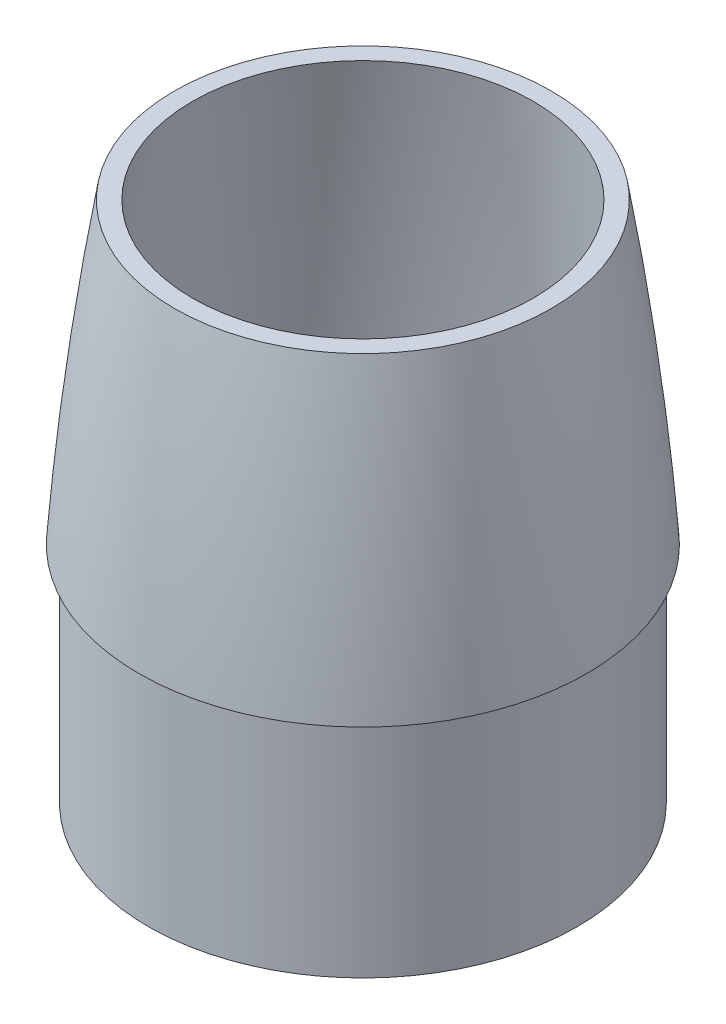
ISO-10303-21;
HEADER;
FILE_DESCRIPTION(('STEP AP214'),'2;1');
FILE_NAME('part.step','',(''),(''),'','','');
FILE_SCHEMA(('AUTOMOTIVE_DESIGN { 1 0 10303 214 1 1 1 1 }'));
ENDSEC;
DATA;
#1=APPLICATION_CONTEXT('core data for automotive mechanical design processes');
#2=APPLICATION_PROTOCOL_DEFINITION('international standard','automotive_design',2000,#1);
#3=PRODUCT_CONTEXT('',#1,'mechanical');
#4=PRODUCT('Part','Part','',(#3));
#5=PRODUCT_RELATED_PRODUCT_CATEGORY('part','',(#4));
#6=PRODUCT_DEFINITION_FORMATION('','',#4);
#7=PRODUCT_DEFINITION_CONTEXT('part definition',#1,'design');
#8=PRODUCT_DEFINITION('design','',#6,#7);
#9=PRODUCT_DEFINITION_SHAPE('','',#8);
#10=(LENGTH_UNIT() NAMED_UNIT(*) SI_UNIT(.MILLI.,.METRE.));
#11=(NAMED_UNIT(*) PLANE_ANGLE_UNIT() SI_UNIT($,.RADIAN.));
#12=(NAMED_UNIT(*) SI_UNIT($,.STERADIAN.) SOLID_ANGLE_UNIT());
#13=UNCERTAINTY_MEASURE_WITH_UNIT(LENGTH_MEASURE(1.E-05),#10,'distance_accuracy_value','');
#14=(GEOMETRIC_REPRESENTATION_CONTEXT(3) GLOBAL_UNCERTAINTY_ASSIGNED_CONTEXT((#13)) GLOBAL_UNIT_ASSIGNED_CONTEXT((#10,
#11,#12)) REPRESENTATION_CONTEXT('',''));
#15=CARTESIAN_POINT('',(0.,0.,0.));
#16=DIRECTION('',(0.,0.,1.));
#17=DIRECTION('',(1.,0.,0.));
#18=AXIS2_PLACEMENT_3D('',#15,#16,#17);
#19=CARTESIAN_POINT('',(2.22044604925031E-13,-77.7824394206784,0.));
#20=DIRECTION('',(0.,1.,0.));
#21=DIRECTION('',(-1.,0.,0.));
#22=AXIS2_PLACEMENT_3D('',#19,#20,#21);
#23=DEGENERATE_TOROIDAL_SURFACE('',#22,1014.39057082294,1093.36082838655,.F.);
#24=CARTESIAN_POINT('',(2.42627023847075E-13,0.,0.));
#25=DIRECTION('',(0.,1.,0.));
#26=DIRECTION('',(-1.,0.,0.));
#27=AXIS2_PLACEMENT_3D('',#24,#25,#26);
#28=CIRCLE('',#27,76.2000000000002);
#29=CARTESIAN_POINT('',(-76.2,0.,0.));
#30=VERTEX_POINT('',#29);
#31=EDGE_CURVE('E47',#30,#30,#28,.T.);
#32=ORIENTED_EDGE('',*,*,#31,.T.);
#33=EDGE_LOOP('',(#32));
#34=FACE_BOUND('',#33,.T.);
#35=CARTESIAN_POINT('',(2.22044604925031E-13,101.6,0.));
#36=DIRECTION('',(0.,1.,0.));
#37=DIRECTION('',(0.,0.,1.));
#38=AXIS2_PLACEMENT_3D('',#35,#36,#37);
#39=CIRCLE('',#38,64.1546723067235);
#40=CARTESIAN_POINT('',(2.22044604925031E-13,101.6,64.1546723067235));
#41=VERTEX_POINT('',#40);
#42=EDGE_CURVE('E58',#41,#41,#39,.F.);
#43=ORIENTED_EDGE('',*,*,#42,.T.);
#44=EDGE_LOOP('',(#43));
#45=FACE_BOUND('',#44,.T.);
#46=ADVANCED_FACE('F39',(#34,#45),#23,.F.);
#47=CARTESIAN_POINT('',(2.22044604925031E-13,-88.4854003678518,0.));
#48=DIRECTION('',(0.,1.,0.));
#49=DIRECTION('',(-1.,0.,0.));
#50=AXIS2_PLACEMENT_3D('',#47,#48,#49);
#51=DEGENERATE_TOROIDAL_SURFACE('',#50,1133.57722716672,1206.67591223346,.F.);
#52=CARTESIAN_POINT('',(2.42627023847075E-13,-1.11022302462516E-13,0.));
#53=DIRECTION('',(0.,1.,0.));
#54=DIRECTION('',(-1.,0.,0.));
#55=AXIS2_PLACEMENT_3D('',#52,#53,#54);
#56=CIRCLE('',#55,69.8500000000002);
#57=CARTESIAN_POINT('',(-69.85,-1.62347249814782E-13,0.));
#58=VERTEX_POINT('',#57);
#59=EDGE_CURVE('E53',#58,#58,#56,.T.);
#60=ORIENTED_EDGE('',*,*,#59,.F.);
#61=EDGE_LOOP('',(#60));
#62=FACE_BOUND('',#61,.T.);
#63=CARTESIAN_POINT('',(2.22044604925031E-13,101.6,0.));
#64=DIRECTION('',(0.,1.,0.));
#65=DIRECTION('',(0.,0.,1.));
#66=AXIS2_PLACEMENT_3D('',#63,#64,#65);
#67=CIRCLE('',#66,58.0327332361936);
#68=CARTESIAN_POINT('',(2.22044604925031E-13,101.6,58.0327332361936));
#69=VERTEX_POINT('',#68);
#70=EDGE_CURVE('E42',#69,#69,#67,.T.);
#71=ORIENTED_EDGE('',*,*,#70,.T.);
#72=EDGE_LOOP('',(#71));
#73=FACE_BOUND('',#72,.T.);
#74=ADVANCED_FACE('F68',(#62,#73),#51,.T.);
#75=CARTESIAN_POINT('',(-76.2,0.,0.));
#76=DIRECTION('',(0.,-1.,0.));
#77=DIRECTION('',(1.,0.,0.));
#78=AXIS2_PLACEMENT_3D('',#75,#76,#77);
#79=PLANE('',#78);
#80=CARTESIAN_POINT('',(0.,0.,0.));
#81=DIRECTION('',(0.,-1.,0.));
#82=DIRECTION('',(1.,0.,0.));
#83=AXIS2_PLACEMENT_3D('',#80,#81,#82);
#84=CIRCLE('',#83,73.025);
#85=CARTESIAN_POINT('',(73.025,-1.2520176551083E-13,0.));
#86=VERTEX_POINT('',#85);
#87=EDGE_CURVE('E10',#86,#86,#84,.T.);
#88=ORIENTED_EDGE('',*,*,#87,.F.);
#89=EDGE_LOOP('',(#88));
#90=FACE_BOUND('',#89,.T.);
#91=ORIENTED_EDGE('',*,*,#31,.F.);
#92=EDGE_LOOP('',(#91));
#93=FACE_BOUND('',#92,.T.);
#94=ADVANCED_FACE('F71',(#90,#93),#79,.T.);
#95=CARTESIAN_POINT('',(0.,101.6,0.));
#96=DIRECTION('',(0.,1.,0.));
#97=DIRECTION('',(0.,0.,1.));
#98=AXIS2_PLACEMENT_3D('',#95,#96,#97);
#99=PLANE('',#98);
#100=ORIENTED_EDGE('',*,*,#42,.F.);
#101=EDGE_LOOP('',(#100));
#102=FACE_BOUND('',#101,.T.);
#103=ORIENTED_EDGE('',*,*,#70,.F.);
#104=EDGE_LOOP('',(#103));
#105=FACE_BOUND('',#104,.T.);
#106=ADVANCED_FACE('F90',(#102,#105),#99,.T.);
#107=CARTESIAN_POINT('',(-1.3064532053304E-13,-76.2,0.));
#108=DIRECTION('',(0.,-1.,0.));
#109=DIRECTION('',(1.,0.,0.));
#110=AXIS2_PLACEMENT_3D('',#107,#108,#109);
#111=PLANE('',#110);
#112=CARTESIAN_POINT('',(-1.3064532053304E-13,-76.2,0.));
#113=DIRECTION('',(0.,-1.,0.));
#114=DIRECTION('',(1.,0.,0.));
#115=AXIS2_PLACEMENT_3D('',#112,#113,#114);
#116=CIRCLE('',#115,73.025);
#117=CARTESIAN_POINT('',(73.0249999999999,-76.2000000000001,0.));
#118=VERTEX_POINT('',#117);
#119=EDGE_CURVE('E56',#118,#118,#116,.T.);
#120=ORIENTED_EDGE('',*,*,#119,.T.);
#121=EDGE_LOOP('',(#120));
#122=FACE_BOUND('',#121,.T.);
#123=CARTESIAN_POINT('',(-1.3064532053304E-13,-76.2,0.));
#124=DIRECTION('',(0.,-1.,0.));
#125=DIRECTION('',(1.,0.,0.));
#126=AXIS2_PLACEMENT_3D('',#123,#124,#125);
#127=CIRCLE('',#126,69.85);
#128=CARTESIAN_POINT('',(69.8499999999999,-76.2000000000001,0.));
#129=VERTEX_POINT('',#128);
#130=EDGE_CURVE('E79',#129,#129,#127,.T.);
#131=ORIENTED_EDGE('',*,*,#130,.F.);
#132=EDGE_LOOP('',(#131));
#133=FACE_BOUND('',#132,.T.);
#134=ADVANCED_FACE('F87',(#122,#133),#111,.T.);
#135=CARTESIAN_POINT('',(-1.3064532053304E-13,-76.2,0.));
#136=DIRECTION('',(0.,1.,0.));
#137=DIRECTION('',(-1.,0.,0.));
#138=AXIS2_PLACEMENT_3D('',#135,#136,#137);
#139=CYLINDRICAL_SURFACE('',#138,73.025);
#140=ORIENTED_EDGE('',*,*,#119,.F.);
#141=EDGE_LOOP('',(#140));
#142=FACE_BOUND('',#141,.T.);
#143=ORIENTED_EDGE('',*,*,#87,.T.);
#144=EDGE_LOOP('',(#143));
#145=FACE_BOUND('',#144,.T.);
#146=ADVANCED_FACE('F89',(#142,#145),#139,.T.);
#147=CARTESIAN_POINT('',(-1.3064532053304E-13,-76.2,0.));
#148=DIRECTION('',(0.,1.,0.));
#149=DIRECTION('',(-1.,0.,0.));
#150=AXIS2_PLACEMENT_3D('',#147,#148,#149);
#151=CYLINDRICAL_SURFACE('',#150,69.85);
#152=ORIENTED_EDGE('',*,*,#130,.T.);
#153=EDGE_LOOP('',(#152));
#154=FACE_BOUND('',#153,.T.);
#155=ORIENTED_EDGE('',*,*,#59,.T.);
#156=EDGE_LOOP('',(#155));
#157=FACE_BOUND('',#156,.T.);
#158=ADVANCED_FACE('F66',(#154,#157),#151,.F.);
#159=CLOSED_SHELL('',(#46,#74,#94,#106,#134,#146,#158));
#160=MANIFOLD_SOLID_BREP('B2',#159);
#161=ADVANCED_BREP_SHAPE_REPRESENTATION('',(#18,#160),#14);
#162=SHAPE_DEFINITION_REPRESENTATION(#9,#161);
ENDSEC;
END-ISO-10303-21;
